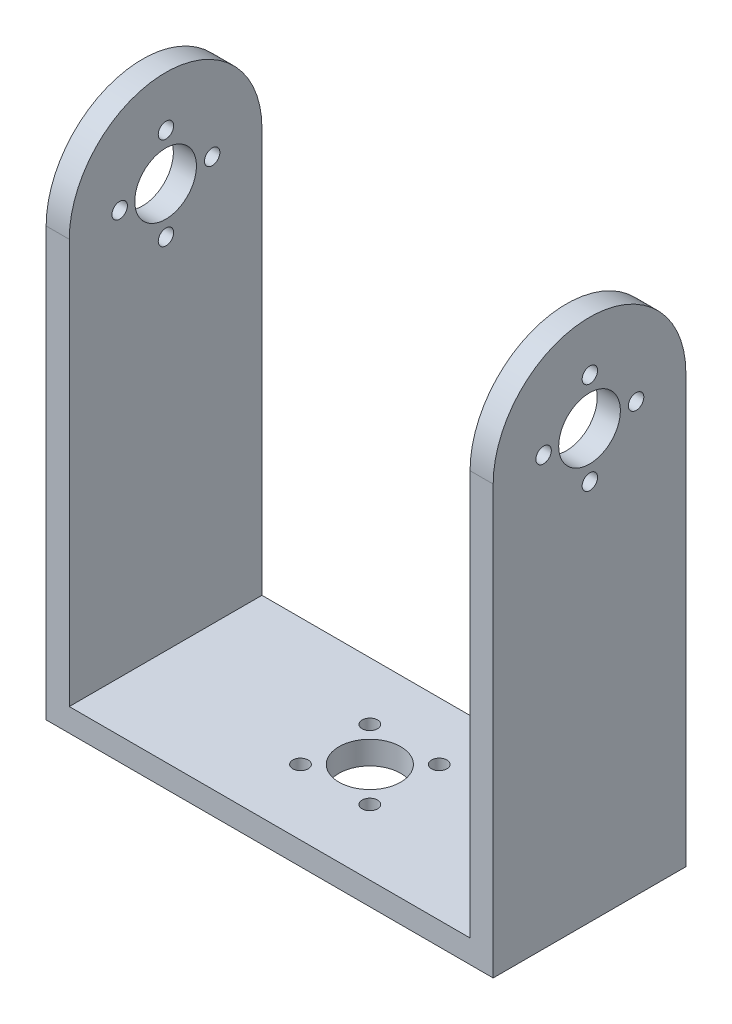
ISO-10303-21;
HEADER;
FILE_DESCRIPTION(('STEP AP214'),'2;1');
FILE_NAME('part.step','',(''),(''),'','','');
FILE_SCHEMA(('AUTOMOTIVE_DESIGN { 1 0 10303 214 1 1 1 1 }'));
ENDSEC;
DATA;
#1=APPLICATION_CONTEXT('core data for automotive mechanical design processes');
#2=APPLICATION_PROTOCOL_DEFINITION('international standard','automotive_design',2000,#1);
#3=PRODUCT_CONTEXT('',#1,'mechanical');
#4=PRODUCT('Part','Part','',(#3));
#5=PRODUCT_RELATED_PRODUCT_CATEGORY('part','',(#4));
#6=PRODUCT_DEFINITION_FORMATION('','',#4);
#7=PRODUCT_DEFINITION_CONTEXT('part definition',#1,'design');
#8=PRODUCT_DEFINITION('design','',#6,#7);
#9=PRODUCT_DEFINITION_SHAPE('','',#8);
#10=(LENGTH_UNIT() NAMED_UNIT(*) SI_UNIT(.MILLI.,.METRE.));
#11=(NAMED_UNIT(*) PLANE_ANGLE_UNIT() SI_UNIT($,.RADIAN.));
#12=(NAMED_UNIT(*) SI_UNIT($,.STERADIAN.) SOLID_ANGLE_UNIT());
#13=UNCERTAINTY_MEASURE_WITH_UNIT(LENGTH_MEASURE(1.E-05),#10,'distance_accuracy_value','');
#14=(GEOMETRIC_REPRESENTATION_CONTEXT(3) GLOBAL_UNCERTAINTY_ASSIGNED_CONTEXT((#13)) GLOBAL_UNIT_ASSIGNED_CONTEXT((#10,
#11,#12)) REPRESENTATION_CONTEXT('',''));
#15=CARTESIAN_POINT('',(0.,0.,0.));
#16=DIRECTION('',(0.,0.,1.));
#17=DIRECTION('',(1.,0.,0.));
#18=AXIS2_PLACEMENT_3D('',#15,#16,#17);
#19=CARTESIAN_POINT('',(0.,3.,0.));
#20=DIRECTION('',(1.,0.,0.));
#21=DIRECTION('',(0.,0.,-1.));
#22=AXIS2_PLACEMENT_3D('',#19,#20,#21);
#23=PLANE('',#22);
#24=CARTESIAN_POINT('',(0.,61.5000000091775,-12.5437200911487));
#25=DIRECTION('',(1.,0.,0.));
#26=DIRECTION('',(0.,0.,-1.));
#27=AXIS2_PLACEMENT_3D('',#24,#25,#26);
#28=CIRCLE('',#27,1.);
#29=CARTESIAN_POINT('',(0.,61.5000000091775,-13.5437200911487));
#30=VERTEX_POINT('',#29);
#31=EDGE_CURVE('E153',#30,#30,#28,.T.);
#32=ORIENTED_EDGE('',*,*,#31,.T.);
#33=EDGE_LOOP('',(#32));
#34=FACE_BOUND('',#33,.T.);
#35=CARTESIAN_POINT('',(0.,55.5000000091775,-18.5437200911487));
#36=DIRECTION('',(1.,0.,0.));
#37=DIRECTION('',(0.,0.,-1.));
#38=AXIS2_PLACEMENT_3D('',#35,#36,#37);
#39=CIRCLE('',#38,1.);
#40=CARTESIAN_POINT('',(0.,55.5000000091775,-19.5437200911487));
#41=VERTEX_POINT('',#40);
#42=EDGE_CURVE('E241',#41,#41,#39,.T.);
#43=ORIENTED_EDGE('',*,*,#42,.T.);
#44=EDGE_LOOP('',(#43));
#45=FACE_BOUND('',#44,.T.);
#46=CARTESIAN_POINT('',(0.,55.5000000091776,-6.54372009114868));
#47=DIRECTION('',(1.,0.,0.));
#48=DIRECTION('',(0.,0.,-1.));
#49=AXIS2_PLACEMENT_3D('',#46,#47,#48);
#50=CIRCLE('',#49,1.);
#51=CARTESIAN_POINT('',(0.,55.5000000091776,-7.54372009114868));
#52=VERTEX_POINT('',#51);
#53=EDGE_CURVE('E245',#52,#52,#50,.T.);
#54=ORIENTED_EDGE('',*,*,#53,.T.);
#55=EDGE_LOOP('',(#54));
#56=FACE_BOUND('',#55,.T.);
#57=CARTESIAN_POINT('',(0.,49.5000000091775,-12.5437200911487));
#58=DIRECTION('',(1.,0.,0.));
#59=DIRECTION('',(0.,0.,-1.));
#60=AXIS2_PLACEMENT_3D('',#57,#58,#59);
#61=CIRCLE('',#60,1.);
#62=CARTESIAN_POINT('',(0.,49.5000000091775,-13.5437200911487));
#63=VERTEX_POINT('',#62);
#64=EDGE_CURVE('E249',#63,#63,#61,.T.);
#65=ORIENTED_EDGE('',*,*,#64,.T.);
#66=EDGE_LOOP('',(#65));
#67=FACE_BOUND('',#66,.T.);
#68=CARTESIAN_POINT('',(0.,55.5,-12.5));
#69=DIRECTION('',(-1.,0.,0.));
#70=DIRECTION('',(0.,0.,1.));
#71=AXIS2_PLACEMENT_3D('',#68,#69,#70);
#72=CIRCLE('',#71,4.);
#73=CARTESIAN_POINT('',(0.,55.5,-8.5));
#74=VERTEX_POINT('',#73);
#75=EDGE_CURVE('E148',#74,#74,#72,.T.);
#76=ORIENTED_EDGE('',*,*,#75,.F.);
#77=EDGE_LOOP('',(#76));
#78=FACE_BOUND('',#77,.T.);
#79=DIRECTION('',(0.,-1.,0.));
#80=VECTOR('',#79,1.);
#81=CARTESIAN_POINT('',(0.,3.,0.));
#82=LINE('',#81,#80);
#83=CARTESIAN_POINT('',(0.,55.5,0.));
#84=VERTEX_POINT('',#83);
#85=CARTESIAN_POINT('',(0.,0.,0.));
#86=VERTEX_POINT('',#85);
#87=EDGE_CURVE('E11',#84,#86,#82,.T.);
#88=ORIENTED_EDGE('',*,*,#87,.F.);
#89=CARTESIAN_POINT('',(0.,55.5,-12.5));
#90=DIRECTION('',(-1.,0.,0.));
#91=DIRECTION('',(0.,0.,1.));
#92=AXIS2_PLACEMENT_3D('',#89,#90,#91);
#93=CIRCLE('',#92,12.5);
#94=CARTESIAN_POINT('',(0.,55.5,-25.));
#95=VERTEX_POINT('',#94);
#96=EDGE_CURVE('E100',#95,#84,#93,.F.);
#97=ORIENTED_EDGE('',*,*,#96,.F.);
#98=DIRECTION('',(0.,-1.,0.));
#99=VECTOR('',#98,1.);
#100=CARTESIAN_POINT('',(0.,3.,-25.));
#101=LINE('',#100,#99);
#102=CARTESIAN_POINT('',(0.,0.,-25.));
#103=VERTEX_POINT('',#102);
#104=EDGE_CURVE('E120',#95,#103,#101,.T.);
#105=ORIENTED_EDGE('',*,*,#104,.T.);
#106=DIRECTION('',(0.,0.,1.));
#107=VECTOR('',#106,1.);
#108=CARTESIAN_POINT('',(0.,0.,0.));
#109=LINE('',#108,#107);
#110=EDGE_CURVE('E119',#103,#86,#109,.T.);
#111=ORIENTED_EDGE('',*,*,#110,.T.);
#112=EDGE_LOOP('',(#88,#97,#105,#111));
#113=FACE_BOUND('',#112,.T.);
#114=ADVANCED_FACE('F32',(#34,#45,#56,#67,#78,#113),#23,.F.);
#115=CARTESIAN_POINT('',(58.,3.,0.));
#116=DIRECTION('',(-1.,0.,0.));
#117=DIRECTION('',(0.,0.,1.));
#118=AXIS2_PLACEMENT_3D('',#115,#116,#117);
#119=PLANE('',#118);
#120=CARTESIAN_POINT('',(58.,61.5000000091775,-12.5437200911487));
#121=DIRECTION('',(1.,0.,0.));
#122=DIRECTION('',(0.,0.,-1.));
#123=AXIS2_PLACEMENT_3D('',#120,#121,#122);
#124=CIRCLE('',#123,1.);
#125=CARTESIAN_POINT('',(58.,61.5000000091775,-13.5437200911487));
#126=VERTEX_POINT('',#125);
#127=EDGE_CURVE('E504',#126,#126,#124,.T.);
#128=ORIENTED_EDGE('',*,*,#127,.F.);
#129=EDGE_LOOP('',(#128));
#130=FACE_BOUND('',#129,.T.);
#131=CARTESIAN_POINT('',(58.,55.5000000091775,-18.5437200911487));
#132=DIRECTION('',(1.,0.,0.));
#133=DIRECTION('',(0.,0.,-1.));
#134=AXIS2_PLACEMENT_3D('',#131,#132,#133);
#135=CIRCLE('',#134,1.);
#136=CARTESIAN_POINT('',(58.,55.5000000091775,-19.5437200911487));
#137=VERTEX_POINT('',#136);
#138=EDGE_CURVE('E508',#137,#137,#135,.T.);
#139=ORIENTED_EDGE('',*,*,#138,.F.);
#140=EDGE_LOOP('',(#139));
#141=FACE_BOUND('',#140,.T.);
#142=CARTESIAN_POINT('',(58.,55.5000000091776,-6.54372009114869));
#143=DIRECTION('',(1.,0.,0.));
#144=DIRECTION('',(0.,0.,-1.));
#145=AXIS2_PLACEMENT_3D('',#142,#143,#144);
#146=CIRCLE('',#145,1.);
#147=CARTESIAN_POINT('',(58.,55.5000000091776,-7.54372009114869));
#148=VERTEX_POINT('',#147);
#149=EDGE_CURVE('E512',#148,#148,#146,.T.);
#150=ORIENTED_EDGE('',*,*,#149,.F.);
#151=EDGE_LOOP('',(#150));
#152=FACE_BOUND('',#151,.T.);
#153=CARTESIAN_POINT('',(58.,49.5000000091775,-12.5437200911487));
#154=DIRECTION('',(1.,0.,0.));
#155=DIRECTION('',(0.,0.,-1.));
#156=AXIS2_PLACEMENT_3D('',#153,#154,#155);
#157=CIRCLE('',#156,1.);
#158=CARTESIAN_POINT('',(58.,49.5000000091775,-13.5437200911487));
#159=VERTEX_POINT('',#158);
#160=EDGE_CURVE('E503',#159,#159,#157,.T.);
#161=ORIENTED_EDGE('',*,*,#160,.F.);
#162=EDGE_LOOP('',(#161));
#163=FACE_BOUND('',#162,.T.);
#164=CARTESIAN_POINT('',(58.,55.5,-12.5));
#165=DIRECTION('',(-1.,0.,0.));
#166=DIRECTION('',(0.,0.,1.));
#167=AXIS2_PLACEMENT_3D('',#164,#165,#166);
#168=CIRCLE('',#167,4.);
#169=CARTESIAN_POINT('',(58.,55.5,-8.5));
#170=VERTEX_POINT('',#169);
#171=EDGE_CURVE('E115',#170,#170,#168,.T.);
#172=ORIENTED_EDGE('',*,*,#171,.T.);
#173=EDGE_LOOP('',(#172));
#174=FACE_BOUND('',#173,.T.);
#175=CARTESIAN_POINT('',(58.,55.5,-12.5));
#176=DIRECTION('',(-1.,0.,0.));
#177=DIRECTION('',(0.,0.,1.));
#178=AXIS2_PLACEMENT_3D('',#175,#176,#177);
#179=CIRCLE('',#178,12.5);
#180=CARTESIAN_POINT('',(58.,55.5,-25.));
#181=VERTEX_POINT('',#180);
#182=CARTESIAN_POINT('',(58.,55.5,0.));
#183=VERTEX_POINT('',#182);
#184=EDGE_CURVE('E187',#181,#183,#179,.F.);
#185=ORIENTED_EDGE('',*,*,#184,.T.);
#186=DIRECTION('',(0.,-1.,0.));
#187=VECTOR('',#186,1.);
#188=CARTESIAN_POINT('',(58.,3.,0.));
#189=LINE('',#188,#187);
#190=CARTESIAN_POINT('',(58.,0.,0.));
#191=VERTEX_POINT('',#190);
#192=EDGE_CURVE('E40',#183,#191,#189,.T.);
#193=ORIENTED_EDGE('',*,*,#192,.T.);
#194=DIRECTION('',(0.,0.,-1.));
#195=VECTOR('',#194,1.);
#196=CARTESIAN_POINT('',(58.,0.,0.));
#197=LINE('',#196,#195);
#198=CARTESIAN_POINT('',(58.,0.,-25.));
#199=VERTEX_POINT('',#198);
#200=EDGE_CURVE('E127',#191,#199,#197,.T.);
#201=ORIENTED_EDGE('',*,*,#200,.T.);
#202=DIRECTION('',(0.,-1.,0.));
#203=VECTOR('',#202,1.);
#204=CARTESIAN_POINT('',(58.,3.,-25.));
#205=LINE('',#204,#203);
#206=EDGE_CURVE('E141',#181,#199,#205,.T.);
#207=ORIENTED_EDGE('',*,*,#206,.F.);
#208=EDGE_LOOP('',(#185,#193,#201,#207));
#209=FACE_BOUND('',#208,.T.);
#210=ADVANCED_FACE('F208',(#130,#141,#152,#163,#174,#209),#119,.F.);
#211=CARTESIAN_POINT('',(55.,68.,-25.));
#212=DIRECTION('',(1.,0.,0.));
#213=DIRECTION('',(0.,0.,-1.));
#214=AXIS2_PLACEMENT_3D('',#211,#212,#213);
#215=PLANE('',#214);
#216=CARTESIAN_POINT('',(55.,61.5000000091775,-12.5437200911487));
#217=DIRECTION('',(1.,0.,0.));
#218=DIRECTION('',(0.,0.,-1.));
#219=AXIS2_PLACEMENT_3D('',#216,#217,#218);
#220=CIRCLE('',#219,1.);
#221=CARTESIAN_POINT('',(55.,61.5000000091775,-13.5437200911487));
#222=VERTEX_POINT('',#221);
#223=EDGE_CURVE('E171',#222,#222,#220,.T.);
#224=ORIENTED_EDGE('',*,*,#223,.T.);
#225=EDGE_LOOP('',(#224));
#226=FACE_BOUND('',#225,.T.);
#227=CARTESIAN_POINT('',(55.,55.5000000091775,-18.5437200911487));
#228=DIRECTION('',(1.,0.,0.));
#229=DIRECTION('',(0.,0.,-1.));
#230=AXIS2_PLACEMENT_3D('',#227,#228,#229);
#231=CIRCLE('',#230,1.);
#232=CARTESIAN_POINT('',(55.,55.5000000091775,-19.5437200911487));
#233=VERTEX_POINT('',#232);
#234=EDGE_CURVE('E159',#233,#233,#231,.T.);
#235=ORIENTED_EDGE('',*,*,#234,.T.);
#236=EDGE_LOOP('',(#235));
#237=FACE_BOUND('',#236,.T.);
#238=CARTESIAN_POINT('',(55.,55.5000000091776,-6.54372009114869));
#239=DIRECTION('',(1.,0.,0.));
#240=DIRECTION('',(0.,0.,-1.));
#241=AXIS2_PLACEMENT_3D('',#238,#239,#240);
#242=CIRCLE('',#241,1.);
#243=CARTESIAN_POINT('',(55.,55.5000000091776,-7.54372009114869));
#244=VERTEX_POINT('',#243);
#245=EDGE_CURVE('E156',#244,#244,#242,.T.);
#246=ORIENTED_EDGE('',*,*,#245,.T.);
#247=EDGE_LOOP('',(#246));
#248=FACE_BOUND('',#247,.T.);
#249=CARTESIAN_POINT('',(55.,49.5000000091775,-12.5437200911487));
#250=DIRECTION('',(1.,0.,0.));
#251=DIRECTION('',(0.,0.,-1.));
#252=AXIS2_PLACEMENT_3D('',#249,#250,#251);
#253=CIRCLE('',#252,1.);
#254=CARTESIAN_POINT('',(55.,49.5000000091775,-13.5437200911487));
#255=VERTEX_POINT('',#254);
#256=EDGE_CURVE('E152',#255,#255,#253,.T.);
#257=ORIENTED_EDGE('',*,*,#256,.T.);
#258=EDGE_LOOP('',(#257));
#259=FACE_BOUND('',#258,.T.);
#260=CARTESIAN_POINT('',(55.,55.5,-12.5));
#261=DIRECTION('',(1.,0.,0.));
#262=DIRECTION('',(0.,0.,-1.));
#263=AXIS2_PLACEMENT_3D('',#260,#261,#262);
#264=CIRCLE('',#263,4.);
#265=CARTESIAN_POINT('',(55.,55.5,-16.5));
#266=VERTEX_POINT('',#265);
#267=EDGE_CURVE('E147',#266,#266,#264,.T.);
#268=ORIENTED_EDGE('',*,*,#267,.T.);
#269=EDGE_LOOP('',(#268));
#270=FACE_BOUND('',#269,.T.);
#271=DIRECTION('',(0.,-1.,0.));
#272=VECTOR('',#271,1.);
#273=CARTESIAN_POINT('',(55.,68.,0.));
#274=LINE('',#273,#272);
#275=CARTESIAN_POINT('',(55.,55.5,0.));
#276=VERTEX_POINT('',#275);
#277=CARTESIAN_POINT('',(55.,3.,0.));
#278=VERTEX_POINT('',#277);
#279=EDGE_CURVE('E129',#276,#278,#274,.T.);
#280=ORIENTED_EDGE('',*,*,#279,.F.);
#281=CARTESIAN_POINT('',(55.,55.5,-12.5));
#282=DIRECTION('',(1.,0.,0.));
#283=DIRECTION('',(0.,0.,-1.));
#284=AXIS2_PLACEMENT_3D('',#281,#282,#283);
#285=CIRCLE('',#284,12.5);
#286=CARTESIAN_POINT('',(55.,55.5,-25.));
#287=VERTEX_POINT('',#286);
#288=EDGE_CURVE('E184',#276,#287,#285,.F.);
#289=ORIENTED_EDGE('',*,*,#288,.T.);
#290=DIRECTION('',(0.,-1.,0.));
#291=VECTOR('',#290,1.);
#292=CARTESIAN_POINT('',(55.,68.,-25.));
#293=LINE('',#292,#291);
#294=CARTESIAN_POINT('',(55.,3.,-25.));
#295=VERTEX_POINT('',#294);
#296=EDGE_CURVE('E125',#287,#295,#293,.T.);
#297=ORIENTED_EDGE('',*,*,#296,.T.);
#298=DIRECTION('',(0.,0.,1.));
#299=VECTOR('',#298,1.);
#300=CARTESIAN_POINT('',(55.,3.,-25.));
#301=LINE('',#300,#299);
#302=EDGE_CURVE('E193',#295,#278,#301,.T.);
#303=ORIENTED_EDGE('',*,*,#302,.T.);
#304=EDGE_LOOP('',(#280,#289,#297,#303));
#305=FACE_BOUND('',#304,.T.);
#306=ADVANCED_FACE('F215',(#226,#237,#248,#259,#270,#305),#215,.F.);
#307=CARTESIAN_POINT('',(3.,68.,-25.));
#308=DIRECTION('',(-1.,0.,0.));
#309=DIRECTION('',(0.,0.,1.));
#310=AXIS2_PLACEMENT_3D('',#307,#308,#309);
#311=PLANE('',#310);
#312=CARTESIAN_POINT('',(3.,61.5000000091775,-12.5437200911487));
#313=DIRECTION('',(-1.,0.,0.));
#314=DIRECTION('',(0.,0.,1.));
#315=AXIS2_PLACEMENT_3D('',#312,#313,#314);
#316=CIRCLE('',#315,1.);
#317=CARTESIAN_POINT('',(3.,61.5000000091775,-11.5437200911487));
#318=VERTEX_POINT('',#317);
#319=EDGE_CURVE('E35',#318,#318,#316,.T.);
#320=ORIENTED_EDGE('',*,*,#319,.T.);
#321=EDGE_LOOP('',(#320));
#322=FACE_BOUND('',#321,.T.);
#323=CARTESIAN_POINT('',(3.,55.5000000091775,-18.5437200911487));
#324=DIRECTION('',(-1.,0.,0.));
#325=DIRECTION('',(0.,0.,1.));
#326=AXIS2_PLACEMENT_3D('',#323,#324,#325);
#327=CIRCLE('',#326,1.);
#328=CARTESIAN_POINT('',(3.,55.5000000091775,-17.5437200911487));
#329=VERTEX_POINT('',#328);
#330=EDGE_CURVE('E157',#329,#329,#327,.T.);
#331=ORIENTED_EDGE('',*,*,#330,.T.);
#332=EDGE_LOOP('',(#331));
#333=FACE_BOUND('',#332,.T.);
#334=CARTESIAN_POINT('',(3.,55.5000000091776,-6.54372009114868));
#335=DIRECTION('',(-1.,0.,0.));
#336=DIRECTION('',(0.,0.,1.));
#337=AXIS2_PLACEMENT_3D('',#334,#335,#336);
#338=CIRCLE('',#337,1.);
#339=CARTESIAN_POINT('',(3.,55.5000000091776,-5.54372009114868));
#340=VERTEX_POINT('',#339);
#341=EDGE_CURVE('E154',#340,#340,#338,.T.);
#342=ORIENTED_EDGE('',*,*,#341,.T.);
#343=EDGE_LOOP('',(#342));
#344=FACE_BOUND('',#343,.T.);
#345=CARTESIAN_POINT('',(3.,49.5000000091775,-12.5437200911487));
#346=DIRECTION('',(-1.,0.,0.));
#347=DIRECTION('',(0.,0.,1.));
#348=AXIS2_PLACEMENT_3D('',#345,#346,#347);
#349=CIRCLE('',#348,1.);
#350=CARTESIAN_POINT('',(3.,49.5000000091775,-11.5437200911487));
#351=VERTEX_POINT('',#350);
#352=EDGE_CURVE('E149',#351,#351,#349,.T.);
#353=ORIENTED_EDGE('',*,*,#352,.T.);
#354=EDGE_LOOP('',(#353));
#355=FACE_BOUND('',#354,.T.);
#356=CARTESIAN_POINT('',(3.,55.5,-12.5));
#357=DIRECTION('',(-1.,0.,0.));
#358=DIRECTION('',(0.,0.,1.));
#359=AXIS2_PLACEMENT_3D('',#356,#357,#358);
#360=CIRCLE('',#359,4.);
#361=CARTESIAN_POINT('',(3.,55.5,-8.5));
#362=VERTEX_POINT('',#361);
#363=EDGE_CURVE('E144',#362,#362,#360,.T.);
#364=ORIENTED_EDGE('',*,*,#363,.T.);
#365=EDGE_LOOP('',(#364));
#366=FACE_BOUND('',#365,.T.);
#367=CARTESIAN_POINT('',(3.,55.5,-12.5));
#368=DIRECTION('',(-1.,0.,0.));
#369=DIRECTION('',(0.,0.,1.));
#370=AXIS2_PLACEMENT_3D('',#367,#368,#369);
#371=CIRCLE('',#370,12.5);
#372=CARTESIAN_POINT('',(3.,55.5,-25.));
#373=VERTEX_POINT('',#372);
#374=CARTESIAN_POINT('',(3.,55.5,0.));
#375=VERTEX_POINT('',#374);
#376=EDGE_CURVE('E182',#373,#375,#371,.F.);
#377=ORIENTED_EDGE('',*,*,#376,.T.);
#378=DIRECTION('',(0.,-1.,0.));
#379=VECTOR('',#378,1.);
#380=CARTESIAN_POINT('',(3.,68.,0.));
#381=LINE('',#380,#379);
#382=CARTESIAN_POINT('',(3.,3.,0.));
#383=VERTEX_POINT('',#382);
#384=EDGE_CURVE('E48',#375,#383,#381,.T.);
#385=ORIENTED_EDGE('',*,*,#384,.T.);
#386=DIRECTION('',(0.,0.,-1.));
#387=VECTOR('',#386,1.);
#388=CARTESIAN_POINT('',(3.,3.,-25.));
#389=LINE('',#388,#387);
#390=CARTESIAN_POINT('',(3.,3.,-25.));
#391=VERTEX_POINT('',#390);
#392=EDGE_CURVE('E189',#383,#391,#389,.T.);
#393=ORIENTED_EDGE('',*,*,#392,.T.);
#394=DIRECTION('',(0.,-1.,0.));
#395=VECTOR('',#394,1.);
#396=CARTESIAN_POINT('',(3.,68.,-25.));
#397=LINE('',#396,#395);
#398=EDGE_CURVE('E56',#373,#391,#397,.T.);
#399=ORIENTED_EDGE('',*,*,#398,.F.);
#400=EDGE_LOOP('',(#377,#385,#393,#399));
#401=FACE_BOUND('',#400,.T.);
#402=ADVANCED_FACE('F201',(#322,#333,#344,#355,#366,#401),#311,.F.);
#403=CARTESIAN_POINT('',(0.,3.,0.));
#404=DIRECTION('',(0.,0.,-1.));
#405=DIRECTION('',(-1.,0.,0.));
#406=AXIS2_PLACEMENT_3D('',#403,#404,#405);
#407=PLANE('',#406);
#408=DIRECTION('',(-1.,0.,0.));
#409=VECTOR('',#408,1.);
#410=CARTESIAN_POINT('',(65.,55.5,0.));
#411=LINE('',#410,#409);
#412=EDGE_CURVE('E103',#375,#84,#411,.T.);
#413=ORIENTED_EDGE('',*,*,#412,.T.);
#414=ORIENTED_EDGE('',*,*,#87,.T.);
#415=DIRECTION('',(1.,0.,0.));
#416=VECTOR('',#415,1.);
#417=CARTESIAN_POINT('',(0.,0.,0.));
#418=LINE('',#417,#416);
#419=EDGE_CURVE('E124',#86,#191,#418,.T.);
#420=ORIENTED_EDGE('',*,*,#419,.T.);
#421=ORIENTED_EDGE('',*,*,#192,.F.);
#422=EDGE_CURVE('E108',#183,#276,#411,.T.);
#423=ORIENTED_EDGE('',*,*,#422,.T.);
#424=ORIENTED_EDGE('',*,*,#279,.T.);
#425=DIRECTION('',(1.,0.,0.));
#426=VECTOR('',#425,1.);
#427=CARTESIAN_POINT('',(0.,3.,0.));
#428=LINE('',#427,#426);
#429=EDGE_CURVE('E139',#383,#278,#428,.T.);
#430=ORIENTED_EDGE('',*,*,#429,.F.);
#431=ORIENTED_EDGE('',*,*,#384,.F.);
#432=EDGE_LOOP('',(#413,#414,#420,#421,#423,#424,#430,#431));
#433=FACE_BOUND('',#432,.T.);
#434=ADVANCED_FACE('F111',(#433),#407,.F.);
#435=CARTESIAN_POINT('',(0.,3.,0.));
#436=DIRECTION('',(0.,-1.,0.));
#437=DIRECTION('',(0.,0.,-1.));
#438=AXIS2_PLACEMENT_3D('',#435,#436,#437);
#439=PLANE('',#438);
#440=CARTESIAN_POINT('',(24.5,3.,-8.5));
#441=DIRECTION('',(0.,-1.,0.));
#442=DIRECTION('',(0.,0.,-1.));
#443=AXIS2_PLACEMENT_3D('',#440,#441,#442);
#444=CIRCLE('',#443,1.);
#445=CARTESIAN_POINT('',(24.5,3.,-9.50000000000001));
#446=VERTEX_POINT('',#445);
#447=EDGE_CURVE('E487',#446,#446,#444,.F.);
#448=ORIENTED_EDGE('',*,*,#447,.F.);
#449=EDGE_LOOP('',(#448));
#450=FACE_BOUND('',#449,.T.);
#451=CARTESIAN_POINT('',(33.5,3.,-8.5));
#452=DIRECTION('',(0.,-1.,0.));
#453=DIRECTION('',(0.,0.,-1.));
#454=AXIS2_PLACEMENT_3D('',#451,#452,#453);
#455=CIRCLE('',#454,0.999999999999998);
#456=CARTESIAN_POINT('',(33.5,3.,-9.5));
#457=VERTEX_POINT('',#456);
#458=EDGE_CURVE('E491',#457,#457,#455,.F.);
#459=ORIENTED_EDGE('',*,*,#458,.F.);
#460=EDGE_LOOP('',(#459));
#461=FACE_BOUND('',#460,.T.);
#462=CARTESIAN_POINT('',(33.5,3.,-17.5));
#463=DIRECTION('',(0.,-1.,0.));
#464=DIRECTION('',(0.,0.,-1.));
#465=AXIS2_PLACEMENT_3D('',#462,#463,#464);
#466=CIRCLE('',#465,0.999999999999998);
#467=CARTESIAN_POINT('',(33.5,3.,-18.5));
#468=VERTEX_POINT('',#467);
#469=EDGE_CURVE('E549',#468,#468,#466,.F.);
#470=ORIENTED_EDGE('',*,*,#469,.F.);
#471=EDGE_LOOP('',(#470));
#472=FACE_BOUND('',#471,.T.);
#473=CARTESIAN_POINT('',(24.5,3.,-17.5));
#474=DIRECTION('',(0.,-1.,0.));
#475=DIRECTION('',(0.,0.,-1.));
#476=AXIS2_PLACEMENT_3D('',#473,#474,#475);
#477=CIRCLE('',#476,1.);
#478=CARTESIAN_POINT('',(24.5,3.,-18.5));
#479=VERTEX_POINT('',#478);
#480=EDGE_CURVE('E500',#479,#479,#477,.F.);
#481=ORIENTED_EDGE('',*,*,#480,.F.);
#482=EDGE_LOOP('',(#481));
#483=FACE_BOUND('',#482,.T.);
#484=CARTESIAN_POINT('',(29.,3.,-13.));
#485=DIRECTION('',(0.,-1.,0.));
#486=DIRECTION('',(0.,0.,-1.));
#487=AXIS2_PLACEMENT_3D('',#484,#485,#486);
#488=CIRCLE('',#487,4.);
#489=CARTESIAN_POINT('',(29.,3.,-17.));
#490=VERTEX_POINT('',#489);
#491=EDGE_CURVE('E499',#490,#490,#488,.F.);
#492=ORIENTED_EDGE('',*,*,#491,.F.);
#493=EDGE_LOOP('',(#492));
#494=FACE_BOUND('',#493,.T.);
#495=ORIENTED_EDGE('',*,*,#392,.F.);
#496=ORIENTED_EDGE('',*,*,#429,.T.);
#497=ORIENTED_EDGE('',*,*,#302,.F.);
#498=DIRECTION('',(-1.,0.,0.));
#499=VECTOR('',#498,1.);
#500=CARTESIAN_POINT('',(0.,3.,-25.));
#501=LINE('',#500,#499);
#502=EDGE_CURVE('E132',#295,#391,#501,.T.);
#503=ORIENTED_EDGE('',*,*,#502,.T.);
#504=EDGE_LOOP('',(#495,#496,#497,#503));
#505=FACE_BOUND('',#504,.T.);
#506=ADVANCED_FACE('F199',(#450,#461,#472,#483,#494,#505),#439,.F.);
#507=CARTESIAN_POINT('',(0.,3.,-25.));
#508=DIRECTION('',(0.,0.,1.));
#509=DIRECTION('',(1.,0.,0.));
#510=AXIS2_PLACEMENT_3D('',#507,#508,#509);
#511=PLANE('',#510);
#512=ORIENTED_EDGE('',*,*,#104,.F.);
#513=DIRECTION('',(-1.,0.,0.));
#514=VECTOR('',#513,1.);
#515=CARTESIAN_POINT('',(65.,55.5,-25.));
#516=LINE('',#515,#514);
#517=EDGE_CURVE('E104',#373,#95,#516,.T.);
#518=ORIENTED_EDGE('',*,*,#517,.F.);
#519=ORIENTED_EDGE('',*,*,#398,.T.);
#520=ORIENTED_EDGE('',*,*,#502,.F.);
#521=ORIENTED_EDGE('',*,*,#296,.F.);
#522=EDGE_CURVE('E181',#181,#287,#516,.T.);
#523=ORIENTED_EDGE('',*,*,#522,.F.);
#524=ORIENTED_EDGE('',*,*,#206,.T.);
#525=DIRECTION('',(-1.,0.,0.));
#526=VECTOR('',#525,1.);
#527=CARTESIAN_POINT('',(0.,0.,-25.));
#528=LINE('',#527,#526);
#529=EDGE_CURVE('E137',#199,#103,#528,.T.);
#530=ORIENTED_EDGE('',*,*,#529,.T.);
#531=EDGE_LOOP('',(#512,#518,#519,#520,#521,#523,#524,#530));
#532=FACE_BOUND('',#531,.T.);
#533=ADVANCED_FACE('F202',(#532),#511,.F.);
#534=CARTESIAN_POINT('',(0.,0.,0.));
#535=DIRECTION('',(0.,-1.,0.));
#536=DIRECTION('',(0.,0.,-1.));
#537=AXIS2_PLACEMENT_3D('',#534,#535,#536);
#538=PLANE('',#537);
#539=CARTESIAN_POINT('',(24.5,0.,-8.5));
#540=DIRECTION('',(0.,-1.,0.));
#541=DIRECTION('',(0.,0.,-1.));
#542=AXIS2_PLACEMENT_3D('',#539,#540,#541);
#543=CIRCLE('',#542,1.);
#544=CARTESIAN_POINT('',(24.5,0.,-9.50000000000001));
#545=VERTEX_POINT('',#544);
#546=EDGE_CURVE('E484',#545,#545,#543,.T.);
#547=ORIENTED_EDGE('',*,*,#546,.F.);
#548=EDGE_LOOP('',(#547));
#549=FACE_BOUND('',#548,.T.);
#550=CARTESIAN_POINT('',(33.5,0.,-8.5));
#551=DIRECTION('',(0.,-1.,0.));
#552=DIRECTION('',(0.,0.,-1.));
#553=AXIS2_PLACEMENT_3D('',#550,#551,#552);
#554=CIRCLE('',#553,0.999999999999998);
#555=CARTESIAN_POINT('',(33.5,0.,-9.5));
#556=VERTEX_POINT('',#555);
#557=EDGE_CURVE('E488',#556,#556,#554,.T.);
#558=ORIENTED_EDGE('',*,*,#557,.F.);
#559=EDGE_LOOP('',(#558));
#560=FACE_BOUND('',#559,.T.);
#561=CARTESIAN_POINT('',(33.5,0.,-17.5));
#562=DIRECTION('',(0.,-1.,0.));
#563=DIRECTION('',(0.,0.,-1.));
#564=AXIS2_PLACEMENT_3D('',#561,#562,#563);
#565=CIRCLE('',#564,0.999999999999998);
#566=CARTESIAN_POINT('',(33.5,0.,-18.5));
#567=VERTEX_POINT('',#566);
#568=EDGE_CURVE('E552',#567,#567,#565,.T.);
#569=ORIENTED_EDGE('',*,*,#568,.F.);
#570=EDGE_LOOP('',(#569));
#571=FACE_BOUND('',#570,.T.);
#572=CARTESIAN_POINT('',(24.5,0.,-17.5));
#573=DIRECTION('',(0.,-1.,0.));
#574=DIRECTION('',(0.,0.,-1.));
#575=AXIS2_PLACEMENT_3D('',#572,#573,#574);
#576=CIRCLE('',#575,1.);
#577=CARTESIAN_POINT('',(24.5,0.,-18.5));
#578=VERTEX_POINT('',#577);
#579=EDGE_CURVE('E544',#578,#578,#576,.T.);
#580=ORIENTED_EDGE('',*,*,#579,.F.);
#581=EDGE_LOOP('',(#580));
#582=FACE_BOUND('',#581,.T.);
#583=CARTESIAN_POINT('',(29.,0.,-13.));
#584=DIRECTION('',(0.,-1.,0.));
#585=DIRECTION('',(0.,0.,-1.));
#586=AXIS2_PLACEMENT_3D('',#583,#584,#585);
#587=CIRCLE('',#586,4.);
#588=CARTESIAN_POINT('',(29.,0.,-17.));
#589=VERTEX_POINT('',#588);
#590=EDGE_CURVE('E496',#589,#589,#587,.T.);
#591=ORIENTED_EDGE('',*,*,#590,.F.);
#592=EDGE_LOOP('',(#591));
#593=FACE_BOUND('',#592,.T.);
#594=ORIENTED_EDGE('',*,*,#110,.F.);
#595=ORIENTED_EDGE('',*,*,#529,.F.);
#596=ORIENTED_EDGE('',*,*,#200,.F.);
#597=ORIENTED_EDGE('',*,*,#419,.F.);
#598=EDGE_LOOP('',(#594,#595,#596,#597));
#599=FACE_BOUND('',#598,.T.);
#600=ADVANCED_FACE('F206',(#549,#560,#571,#582,#593,#599),#538,.T.);
#601=CARTESIAN_POINT('',(65.,55.5,-12.5));
#602=DIRECTION('',(-1.,0.,0.));
#603=DIRECTION('',(0.,0.,1.));
#604=AXIS2_PLACEMENT_3D('',#601,#602,#603);
#605=CYLINDRICAL_SURFACE('',#604,12.5);
#606=ORIENTED_EDGE('',*,*,#517,.T.);
#607=ORIENTED_EDGE('',*,*,#96,.T.);
#608=ORIENTED_EDGE('',*,*,#412,.F.);
#609=ORIENTED_EDGE('',*,*,#376,.F.);
#610=EDGE_LOOP('',(#606,#607,#608,#609));
#611=FACE_BOUND('',#610,.T.);
#612=ADVANCED_FACE('F102',(#611),#605,.T.);
#613=ORIENTED_EDGE('',*,*,#522,.T.);
#614=ORIENTED_EDGE('',*,*,#288,.F.);
#615=ORIENTED_EDGE('',*,*,#422,.F.);
#616=ORIENTED_EDGE('',*,*,#184,.F.);
#617=EDGE_LOOP('',(#613,#614,#615,#616));
#618=FACE_BOUND('',#617,.T.);
#619=ADVANCED_FACE('F216',(#618),#605,.T.);
#620=CARTESIAN_POINT('',(65.,55.5,-12.5));
#621=DIRECTION('',(-1.,0.,0.));
#622=DIRECTION('',(0.,0.,1.));
#623=AXIS2_PLACEMENT_3D('',#620,#621,#622);
#624=CYLINDRICAL_SURFACE('',#623,4.);
#625=ORIENTED_EDGE('',*,*,#75,.T.);
#626=EDGE_LOOP('',(#625));
#627=FACE_BOUND('',#626,.T.);
#628=ORIENTED_EDGE('',*,*,#363,.F.);
#629=EDGE_LOOP('',(#628));
#630=FACE_BOUND('',#629,.T.);
#631=ADVANCED_FACE('F218',(#627,#630),#624,.F.);
#632=ORIENTED_EDGE('',*,*,#267,.F.);
#633=EDGE_LOOP('',(#632));
#634=FACE_BOUND('',#633,.T.);
#635=ORIENTED_EDGE('',*,*,#171,.F.);
#636=EDGE_LOOP('',(#635));
#637=FACE_BOUND('',#636,.T.);
#638=ADVANCED_FACE('F224',(#634,#637),#624,.F.);
#639=CARTESIAN_POINT('',(0.,49.5000000091775,-12.5437200911487));
#640=DIRECTION('',(1.,0.,0.));
#641=DIRECTION('',(0.,0.,-1.));
#642=AXIS2_PLACEMENT_3D('',#639,#640,#641);
#643=CYLINDRICAL_SURFACE('',#642,1.);
#644=ORIENTED_EDGE('',*,*,#64,.F.);
#645=EDGE_LOOP('',(#644));
#646=FACE_BOUND('',#645,.T.);
#647=ORIENTED_EDGE('',*,*,#352,.F.);
#648=EDGE_LOOP('',(#647));
#649=FACE_BOUND('',#648,.T.);
#650=ADVANCED_FACE('F305',(#646,#649),#643,.F.);
#651=CARTESIAN_POINT('',(0.,55.5000000091776,-6.54372009114868));
#652=DIRECTION('',(1.,0.,0.));
#653=DIRECTION('',(0.,0.,-1.));
#654=AXIS2_PLACEMENT_3D('',#651,#652,#653);
#655=CYLINDRICAL_SURFACE('',#654,1.);
#656=ORIENTED_EDGE('',*,*,#53,.F.);
#657=EDGE_LOOP('',(#656));
#658=FACE_BOUND('',#657,.T.);
#659=ORIENTED_EDGE('',*,*,#341,.F.);
#660=EDGE_LOOP('',(#659));
#661=FACE_BOUND('',#660,.T.);
#662=ADVANCED_FACE('F338',(#658,#661),#655,.F.);
#663=CARTESIAN_POINT('',(0.,55.5000000091775,-18.5437200911487));
#664=DIRECTION('',(1.,0.,0.));
#665=DIRECTION('',(0.,0.,-1.));
#666=AXIS2_PLACEMENT_3D('',#663,#664,#665);
#667=CYLINDRICAL_SURFACE('',#666,1.);
#668=ORIENTED_EDGE('',*,*,#42,.F.);
#669=EDGE_LOOP('',(#668));
#670=FACE_BOUND('',#669,.T.);
#671=ORIENTED_EDGE('',*,*,#330,.F.);
#672=EDGE_LOOP('',(#671));
#673=FACE_BOUND('',#672,.T.);
#674=ADVANCED_FACE('F349',(#670,#673),#667,.F.);
#675=CARTESIAN_POINT('',(0.,61.5000000091775,-12.5437200911487));
#676=DIRECTION('',(1.,0.,0.));
#677=DIRECTION('',(0.,0.,-1.));
#678=AXIS2_PLACEMENT_3D('',#675,#676,#677);
#679=CYLINDRICAL_SURFACE('',#678,1.);
#680=ORIENTED_EDGE('',*,*,#31,.F.);
#681=EDGE_LOOP('',(#680));
#682=FACE_BOUND('',#681,.T.);
#683=ORIENTED_EDGE('',*,*,#319,.F.);
#684=EDGE_LOOP('',(#683));
#685=FACE_BOUND('',#684,.T.);
#686=ADVANCED_FACE('F360',(#682,#685),#679,.F.);
#687=ORIENTED_EDGE('',*,*,#160,.T.);
#688=EDGE_LOOP('',(#687));
#689=FACE_BOUND('',#688,.T.);
#690=ORIENTED_EDGE('',*,*,#256,.F.);
#691=EDGE_LOOP('',(#690));
#692=FACE_BOUND('',#691,.T.);
#693=ADVANCED_FACE('F341',(#689,#692),#643,.F.);
#694=ORIENTED_EDGE('',*,*,#149,.T.);
#695=EDGE_LOOP('',(#694));
#696=FACE_BOUND('',#695,.T.);
#697=ORIENTED_EDGE('',*,*,#245,.F.);
#698=EDGE_LOOP('',(#697));
#699=FACE_BOUND('',#698,.T.);
#700=ADVANCED_FACE('F352',(#696,#699),#655,.F.);
#701=ORIENTED_EDGE('',*,*,#138,.T.);
#702=EDGE_LOOP('',(#701));
#703=FACE_BOUND('',#702,.T.);
#704=ORIENTED_EDGE('',*,*,#234,.F.);
#705=EDGE_LOOP('',(#704));
#706=FACE_BOUND('',#705,.T.);
#707=ADVANCED_FACE('F363',(#703,#706),#667,.F.);
#708=ORIENTED_EDGE('',*,*,#127,.T.);
#709=EDGE_LOOP('',(#708));
#710=FACE_BOUND('',#709,.T.);
#711=ORIENTED_EDGE('',*,*,#223,.F.);
#712=EDGE_LOOP('',(#711));
#713=FACE_BOUND('',#712,.T.);
#714=ADVANCED_FACE('F373',(#710,#713),#679,.F.);
#715=CARTESIAN_POINT('',(29.,68.001,-13.));
#716=DIRECTION('',(0.,-1.,0.));
#717=DIRECTION('',(0.,0.,-1.));
#718=AXIS2_PLACEMENT_3D('',#715,#716,#717);
#719=CYLINDRICAL_SURFACE('',#718,4.);
#720=ORIENTED_EDGE('',*,*,#590,.T.);
#721=EDGE_LOOP('',(#720));
#722=FACE_BOUND('',#721,.T.);
#723=ORIENTED_EDGE('',*,*,#491,.T.);
#724=EDGE_LOOP('',(#723));
#725=FACE_BOUND('',#724,.T.);
#726=ADVANCED_FACE('F404',(#722,#725),#719,.F.);
#727=CARTESIAN_POINT('',(24.5,68.001,-17.5));
#728=DIRECTION('',(0.,-1.,0.));
#729=DIRECTION('',(0.,0.,-1.));
#730=AXIS2_PLACEMENT_3D('',#727,#728,#729);
#731=CYLINDRICAL_SURFACE('',#730,1.);
#732=ORIENTED_EDGE('',*,*,#579,.T.);
#733=EDGE_LOOP('',(#732));
#734=FACE_BOUND('',#733,.T.);
#735=ORIENTED_EDGE('',*,*,#480,.T.);
#736=EDGE_LOOP('',(#735));
#737=FACE_BOUND('',#736,.T.);
#738=ADVANCED_FACE('F437',(#734,#737),#731,.F.);
#739=CARTESIAN_POINT('',(33.5,68.001,-17.5));
#740=DIRECTION('',(0.,-1.,0.));
#741=DIRECTION('',(0.,0.,-1.));
#742=AXIS2_PLACEMENT_3D('',#739,#740,#741);
#743=CYLINDRICAL_SURFACE('',#742,0.999999999999998);
#744=ORIENTED_EDGE('',*,*,#568,.T.);
#745=EDGE_LOOP('',(#744));
#746=FACE_BOUND('',#745,.T.);
#747=ORIENTED_EDGE('',*,*,#469,.T.);
#748=EDGE_LOOP('',(#747));
#749=FACE_BOUND('',#748,.T.);
#750=ADVANCED_FACE('F444',(#746,#749),#743,.F.);
#751=CARTESIAN_POINT('',(33.5,68.001,-8.5));
#752=DIRECTION('',(0.,-1.,0.));
#753=DIRECTION('',(0.,0.,-1.));
#754=AXIS2_PLACEMENT_3D('',#751,#752,#753);
#755=CYLINDRICAL_SURFACE('',#754,0.999999999999998);
#756=ORIENTED_EDGE('',*,*,#557,.T.);
#757=EDGE_LOOP('',(#756));
#758=FACE_BOUND('',#757,.T.);
#759=ORIENTED_EDGE('',*,*,#458,.T.);
#760=EDGE_LOOP('',(#759));
#761=FACE_BOUND('',#760,.T.);
#762=ADVANCED_FACE('F452',(#758,#761),#755,.F.);
#763=CARTESIAN_POINT('',(24.5,68.001,-8.5));
#764=DIRECTION('',(0.,-1.,0.));
#765=DIRECTION('',(0.,0.,-1.));
#766=AXIS2_PLACEMENT_3D('',#763,#764,#765);
#767=CYLINDRICAL_SURFACE('',#766,1.);
#768=ORIENTED_EDGE('',*,*,#546,.T.);
#769=EDGE_LOOP('',(#768));
#770=FACE_BOUND('',#769,.T.);
#771=ORIENTED_EDGE('',*,*,#447,.T.);
#772=EDGE_LOOP('',(#771));
#773=FACE_BOUND('',#772,.T.);
#774=ADVANCED_FACE('F460',(#770,#773),#767,.F.);
#775=CLOSED_SHELL('',(#114,#210,#306,#402,#434,#506,#533,#600,#612,#619,#631,#638,#650,#662,
#674,#686,#693,#700,#707,#714,#726,#738,#750,#762,#774));
#776=MANIFOLD_SOLID_BREP('B2',#775);
#777=ADVANCED_BREP_SHAPE_REPRESENTATION('',(#18,#776),#14);
#778=SHAPE_DEFINITION_REPRESENTATION(#9,#777);
ENDSEC;
END-ISO-10303-21;
